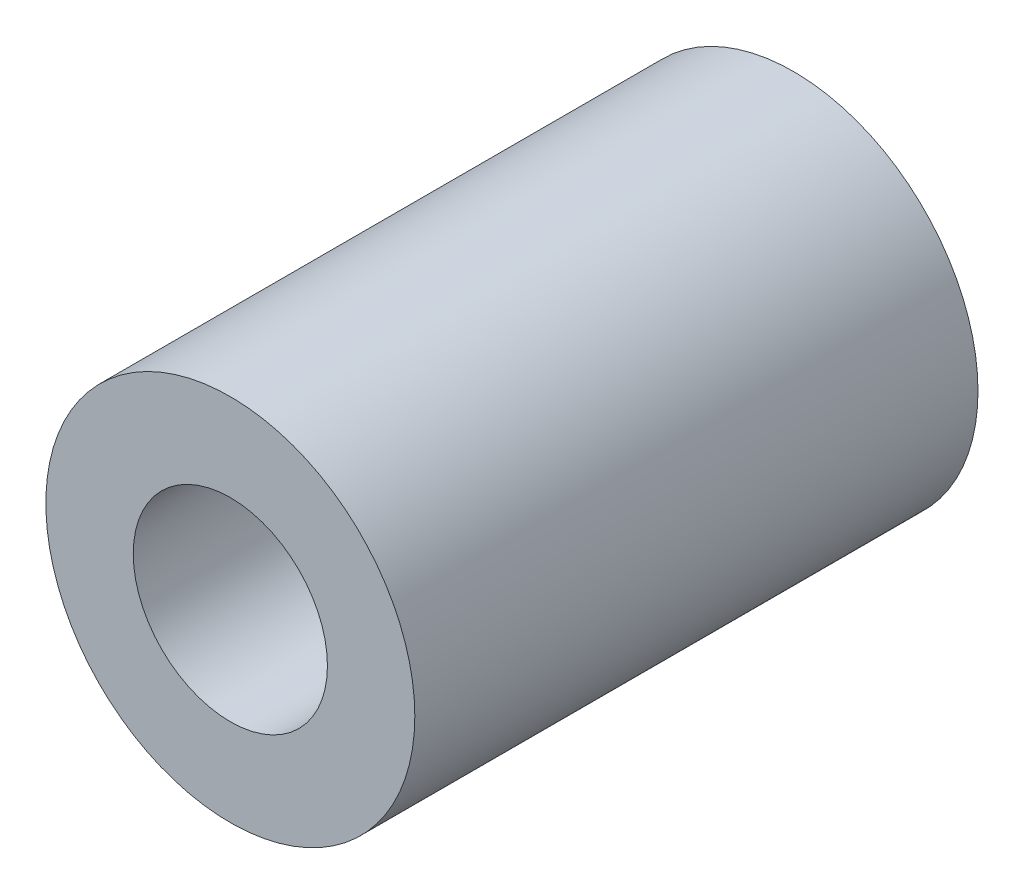
ISO-10303-21;
HEADER;
FILE_DESCRIPTION(('STEP AP214'),'2;1');
FILE_NAME('part.step','',(''),(''),'','','');
FILE_SCHEMA(('AUTOMOTIVE_DESIGN { 1 0 10303 214 1 1 1 1 }'));
ENDSEC;
DATA;
#1=APPLICATION_CONTEXT('core data for automotive mechanical design processes');
#2=APPLICATION_PROTOCOL_DEFINITION('international standard','automotive_design',2000,#1);
#3=PRODUCT_CONTEXT('',#1,'mechanical');
#4=PRODUCT('Part','Part','',(#3));
#5=PRODUCT_RELATED_PRODUCT_CATEGORY('part','',(#4));
#6=PRODUCT_DEFINITION_FORMATION('','',#4);
#7=PRODUCT_DEFINITION_CONTEXT('part definition',#1,'design');
#8=PRODUCT_DEFINITION('design','',#6,#7);
#9=PRODUCT_DEFINITION_SHAPE('','',#8);
#10=(LENGTH_UNIT() NAMED_UNIT(*) SI_UNIT(.MILLI.,.METRE.));
#11=(NAMED_UNIT(*) PLANE_ANGLE_UNIT() SI_UNIT($,.RADIAN.));
#12=(NAMED_UNIT(*) SI_UNIT($,.STERADIAN.) SOLID_ANGLE_UNIT());
#13=UNCERTAINTY_MEASURE_WITH_UNIT(LENGTH_MEASURE(1.E-05),#10,'distance_accuracy_value','');
#14=(GEOMETRIC_REPRESENTATION_CONTEXT(3) GLOBAL_UNCERTAINTY_ASSIGNED_CONTEXT((#13)) GLOBAL_UNIT_ASSIGNED_CONTEXT((#10,
#11,#12)) REPRESENTATION_CONTEXT('',''));
#15=CARTESIAN_POINT('',(0.,0.,0.));
#16=DIRECTION('',(0.,0.,1.));
#17=DIRECTION('',(1.,0.,0.));
#18=AXIS2_PLACEMENT_3D('',#15,#16,#17);
#19=CARTESIAN_POINT('',(0.,0.,29.));
#20=DIRECTION('',(0.,0.,1.));
#21=DIRECTION('',(1.,0.,0.));
#22=AXIS2_PLACEMENT_3D('',#19,#20,#21);
#23=PLANE('',#22);
#24=CARTESIAN_POINT('',(0.,0.,29.));
#25=DIRECTION('',(0.,0.,1.));
#26=DIRECTION('',(1.,0.,0.));
#27=AXIS2_PLACEMENT_3D('',#24,#25,#26);
#28=CIRCLE('',#27,9.5);
#29=CARTESIAN_POINT('',(9.5,0.,29.));
#30=VERTEX_POINT('',#29);
#31=EDGE_CURVE('E10',#30,#30,#28,.T.);
#32=ORIENTED_EDGE('',*,*,#31,.T.);
#33=EDGE_LOOP('',(#32));
#34=FACE_BOUND('',#33,.T.);
#35=CARTESIAN_POINT('',(0.,0.,29.));
#36=DIRECTION('',(0.,0.,1.));
#37=DIRECTION('',(1.,0.,0.));
#38=AXIS2_PLACEMENT_3D('',#35,#36,#37);
#39=CIRCLE('',#38,5.);
#40=CARTESIAN_POINT('',(5.,0.,29.));
#41=VERTEX_POINT('',#40);
#42=EDGE_CURVE('E46',#41,#41,#39,.T.);
#43=ORIENTED_EDGE('',*,*,#42,.F.);
#44=EDGE_LOOP('',(#43));
#45=FACE_BOUND('',#44,.T.);
#46=ADVANCED_FACE('F35',(#34,#45),#23,.T.);
#47=CARTESIAN_POINT('',(0.,0.,0.));
#48=DIRECTION('',(0.,0.,1.));
#49=DIRECTION('',(1.,0.,0.));
#50=AXIS2_PLACEMENT_3D('',#47,#48,#49);
#51=PLANE('',#50);
#52=CARTESIAN_POINT('',(0.,0.,0.));
#53=DIRECTION('',(0.,0.,1.));
#54=DIRECTION('',(1.,0.,0.));
#55=AXIS2_PLACEMENT_3D('',#52,#53,#54);
#56=CIRCLE('',#55,9.5);
#57=CARTESIAN_POINT('',(9.5,0.,0.));
#58=VERTEX_POINT('',#57);
#59=EDGE_CURVE('E39',#58,#58,#56,.T.);
#60=ORIENTED_EDGE('',*,*,#59,.F.);
#61=EDGE_LOOP('',(#60));
#62=FACE_BOUND('',#61,.T.);
#63=CARTESIAN_POINT('',(0.,0.,0.));
#64=DIRECTION('',(0.,0.,1.));
#65=DIRECTION('',(1.,0.,0.));
#66=AXIS2_PLACEMENT_3D('',#63,#64,#65);
#67=CIRCLE('',#66,5.);
#68=CARTESIAN_POINT('',(5.,0.,0.));
#69=VERTEX_POINT('',#68);
#70=EDGE_CURVE('E48',#69,#69,#67,.T.);
#71=ORIENTED_EDGE('',*,*,#70,.T.);
#72=EDGE_LOOP('',(#71));
#73=FACE_BOUND('',#72,.T.);
#74=ADVANCED_FACE('F58',(#62,#73),#51,.F.);
#75=CARTESIAN_POINT('',(0.,0.,29.));
#76=DIRECTION('',(0.,0.,-1.));
#77=DIRECTION('',(-1.,0.,0.));
#78=AXIS2_PLACEMENT_3D('',#75,#76,#77);
#79=CYLINDRICAL_SURFACE('',#78,9.5);
#80=ORIENTED_EDGE('',*,*,#31,.F.);
#81=EDGE_LOOP('',(#80));
#82=FACE_BOUND('',#81,.T.);
#83=ORIENTED_EDGE('',*,*,#59,.T.);
#84=EDGE_LOOP('',(#83));
#85=FACE_BOUND('',#84,.T.);
#86=ADVANCED_FACE('F37',(#82,#85),#79,.T.);
#87=CARTESIAN_POINT('',(0.,0.,29.));
#88=DIRECTION('',(0.,0.,-1.));
#89=DIRECTION('',(-1.,0.,0.));
#90=AXIS2_PLACEMENT_3D('',#87,#88,#89);
#91=CYLINDRICAL_SURFACE('',#90,5.);
#92=ORIENTED_EDGE('',*,*,#42,.T.);
#93=EDGE_LOOP('',(#92));
#94=FACE_BOUND('',#93,.T.);
#95=ORIENTED_EDGE('',*,*,#70,.F.);
#96=EDGE_LOOP('',(#95));
#97=FACE_BOUND('',#96,.T.);
#98=ADVANCED_FACE('F54',(#94,#97),#91,.F.);
#99=CLOSED_SHELL('',(#46,#74,#86,#98));
#100=MANIFOLD_SOLID_BREP('B2',#99);
#101=ADVANCED_BREP_SHAPE_REPRESENTATION('',(#18,#100),#14);
#102=SHAPE_DEFINITION_REPRESENTATION(#9,#101);
ENDSEC;
END-ISO-10303-21;
